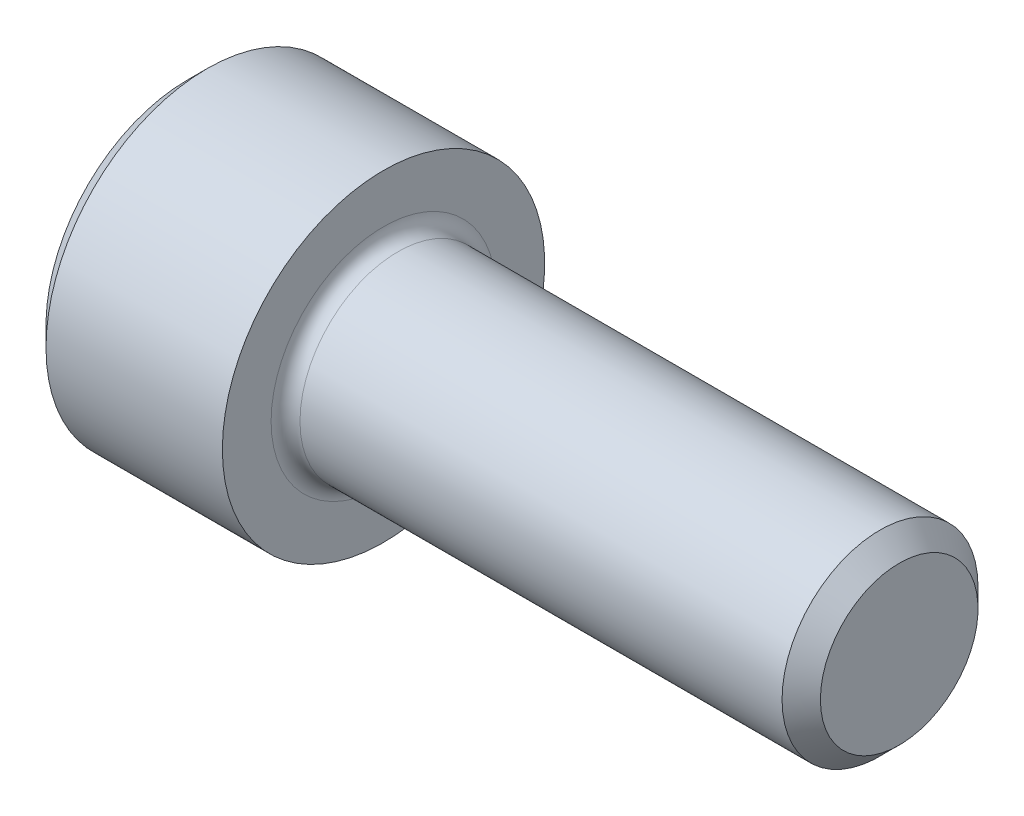
ISO-10303-21;
HEADER;
FILE_DESCRIPTION(('STEP AP214'),'2;1');
FILE_NAME('part.step','',(''),(''),'','','');
FILE_SCHEMA(('AUTOMOTIVE_DESIGN { 1 0 10303 214 1 1 1 1 }'));
ENDSEC;
DATA;
#1=APPLICATION_CONTEXT('core data for automotive mechanical design processes');
#2=APPLICATION_PROTOCOL_DEFINITION('international standard','automotive_design',2000,#1);
#3=PRODUCT_CONTEXT('',#1,'mechanical');
#4=PRODUCT('Part','Part','',(#3));
#5=PRODUCT_RELATED_PRODUCT_CATEGORY('part','',(#4));
#6=PRODUCT_DEFINITION_FORMATION('','',#4);
#7=PRODUCT_DEFINITION_CONTEXT('part definition',#1,'design');
#8=PRODUCT_DEFINITION('design','',#6,#7);
#9=PRODUCT_DEFINITION_SHAPE('','',#8);
#10=(LENGTH_UNIT() NAMED_UNIT(*) SI_UNIT(.MILLI.,.METRE.));
#11=(NAMED_UNIT(*) PLANE_ANGLE_UNIT() SI_UNIT($,.RADIAN.));
#12=(NAMED_UNIT(*) SI_UNIT($,.STERADIAN.) SOLID_ANGLE_UNIT());
#13=UNCERTAINTY_MEASURE_WITH_UNIT(LENGTH_MEASURE(1.E-05),#10,'distance_accuracy_value','');
#14=(GEOMETRIC_REPRESENTATION_CONTEXT(3) GLOBAL_UNCERTAINTY_ASSIGNED_CONTEXT((#13)) GLOBAL_UNIT_ASSIGNED_CONTEXT((#10,
#11,#12)) REPRESENTATION_CONTEXT('',''));
#15=CARTESIAN_POINT('',(0.,0.,0.));
#16=DIRECTION('',(0.,0.,1.));
#17=DIRECTION('',(1.,0.,0.));
#18=AXIS2_PLACEMENT_3D('',#15,#16,#17);
#19=CARTESIAN_POINT('',(2.286,1.14604605784411,1.98501));
#20=DIRECTION('',(-1.,0.,0.));
#21=DIRECTION('',(0.,0.,1.));
#22=AXIS2_PLACEMENT_3D('',#19,#20,#21);
#23=PLANE('',#22);
#24=DIRECTION('',(0.,0.500000000000001,0.866025403784438));
#25=VECTOR('',#24,1.);
#26=CARTESIAN_POINT('',(2.286,-1.71906908676614,0.992505));
#27=LINE('',#26,#25);
#28=CARTESIAN_POINT('',(2.2859999999804,-1.71906908679011,0.992505000013839));
#29=VERTEX_POINT('',#28);
#30=CARTESIAN_POINT('',(2.286,-1.14604605784409,1.98501));
#31=VERTEX_POINT('',#30);
#32=EDGE_CURVE('E102',#29,#31,#27,.T.);
#33=ORIENTED_EDGE('',*,*,#32,.T.);
#34=DIRECTION('',(0.,1.,0.));
#35=VECTOR('',#34,1.);
#36=CARTESIAN_POINT('',(2.286,1.14604605784411,1.98501));
#37=LINE('',#36,#35);
#38=CARTESIAN_POINT('',(2.28599999998701,0.,1.98501000001309));
#39=VERTEX_POINT('',#38);
#40=EDGE_CURVE('E97',#31,#39,#37,.T.);
#41=ORIENTED_EDGE('',*,*,#40,.T.);
#42=CARTESIAN_POINT('',(2.2859999999608,0.,0.));
#43=DIRECTION('',(-1.,0.,0.));
#44=DIRECTION('',(0.,0.,1.));
#45=AXIS2_PLACEMENT_3D('',#42,#43,#44);
#46=CIRCLE('',#45,1.98501000005535);
#47=EDGE_CURVE('E99',#39,#29,#46,.F.);
#48=ORIENTED_EDGE('',*,*,#47,.T.);
#49=EDGE_LOOP('',(#33,#41,#48));
#50=FACE_BOUND('',#49,.T.);
#51=ADVANCED_FACE('F18',(#50),#23,.T.);
#52=CARTESIAN_POINT('',(2.286,1.14604605784411,1.98501));
#53=DIRECTION('',(-1.,0.,0.));
#54=DIRECTION('',(0.,0.,1.));
#55=AXIS2_PLACEMENT_3D('',#52,#53,#54);
#56=PLANE('',#55);
#57=DIRECTION('',(0.,-0.499999999999998,0.86602540378444));
#58=VECTOR('',#57,1.);
#59=CARTESIAN_POINT('',(2.286,-1.71906908676615,-0.992504999999996));
#60=LINE('',#59,#58);
#61=CARTESIAN_POINT('',(2.2859999999804,-1.71906908679012,-0.992505000013836));
#62=VERTEX_POINT('',#61);
#63=CARTESIAN_POINT('',(2.286,-2.29209211568819,0.));
#64=VERTEX_POINT('',#63);
#65=EDGE_CURVE('E106',#62,#64,#60,.T.);
#66=ORIENTED_EDGE('',*,*,#65,.T.);
#67=DIRECTION('',(0.,0.500000000000001,0.866025403784438));
#68=VECTOR('',#67,1.);
#69=CARTESIAN_POINT('',(2.286,-2.29209211568819,0.));
#70=LINE('',#69,#68);
#71=EDGE_CURVE('E173',#64,#29,#70,.T.);
#72=ORIENTED_EDGE('',*,*,#71,.T.);
#73=CARTESIAN_POINT('',(2.2859999999608,0.,0.));
#74=DIRECTION('',(-1.,0.,0.));
#75=DIRECTION('',(0.,0.,1.));
#76=AXIS2_PLACEMENT_3D('',#73,#74,#75);
#77=CIRCLE('',#76,1.98501000005535);
#78=EDGE_CURVE('E118',#29,#62,#77,.F.);
#79=ORIENTED_EDGE('',*,*,#78,.T.);
#80=EDGE_LOOP('',(#66,#72,#79));
#81=FACE_BOUND('',#80,.T.);
#82=ADVANCED_FACE('F349',(#81),#56,.T.);
#83=CARTESIAN_POINT('',(2.286,1.14604605784411,1.98501));
#84=DIRECTION('',(-1.,0.,0.));
#85=DIRECTION('',(0.,0.,1.));
#86=AXIS2_PLACEMENT_3D('',#83,#84,#85);
#87=PLANE('',#86);
#88=DIRECTION('',(0.,1.,0.));
#89=VECTOR('',#88,1.);
#90=CARTESIAN_POINT('',(2.286,1.14604605784411,-1.98501));
#91=LINE('',#90,#89);
#92=CARTESIAN_POINT('',(2.28599999998701,0.,-1.98501000001309));
#93=VERTEX_POINT('',#92);
#94=CARTESIAN_POINT('',(2.286,-1.1460460578441,-1.98501));
#95=VERTEX_POINT('',#94);
#96=EDGE_CURVE('E168',#93,#95,#91,.F.);
#97=ORIENTED_EDGE('',*,*,#96,.T.);
#98=DIRECTION('',(0.,-0.499999999999999,0.866025403784439));
#99=VECTOR('',#98,1.);
#100=CARTESIAN_POINT('',(2.286,-1.1460460578441,-1.98501));
#101=LINE('',#100,#99);
#102=EDGE_CURVE('E163',#95,#62,#101,.T.);
#103=ORIENTED_EDGE('',*,*,#102,.T.);
#104=CARTESIAN_POINT('',(2.2859999999608,0.,0.));
#105=DIRECTION('',(-1.,0.,0.));
#106=DIRECTION('',(0.,0.,1.));
#107=AXIS2_PLACEMENT_3D('',#104,#105,#106);
#108=CIRCLE('',#107,1.98501000005535);
#109=EDGE_CURVE('E226',#62,#93,#108,.F.);
#110=ORIENTED_EDGE('',*,*,#109,.T.);
#111=EDGE_LOOP('',(#97,#103,#110));
#112=FACE_BOUND('',#111,.T.);
#113=ADVANCED_FACE('F346',(#112),#87,.T.);
#114=CARTESIAN_POINT('',(2.286,1.14604605784411,1.98501));
#115=DIRECTION('',(-1.,0.,0.));
#116=DIRECTION('',(0.,0.,1.));
#117=AXIS2_PLACEMENT_3D('',#114,#115,#116);
#118=PLANE('',#117);
#119=DIRECTION('',(0.,-0.500000000000001,-0.866025403784438));
#120=VECTOR('',#119,1.);
#121=CARTESIAN_POINT('',(2.286,1.71906908676615,-0.992505000000006));
#122=LINE('',#121,#120);
#123=CARTESIAN_POINT('',(2.2859999999804,1.71906908679012,-0.992505000013843));
#124=VERTEX_POINT('',#123);
#125=CARTESIAN_POINT('',(2.286,1.1460460578441,-1.98501));
#126=VERTEX_POINT('',#125);
#127=EDGE_CURVE('E158',#124,#126,#122,.T.);
#128=ORIENTED_EDGE('',*,*,#127,.T.);
#129=DIRECTION('',(0.,1.,0.));
#130=VECTOR('',#129,1.);
#131=CARTESIAN_POINT('',(2.286,1.14604605784411,-1.98501));
#132=LINE('',#131,#130);
#133=EDGE_CURVE('E153',#126,#93,#132,.F.);
#134=ORIENTED_EDGE('',*,*,#133,.T.);
#135=CARTESIAN_POINT('',(2.2859999999608,0.,0.));
#136=DIRECTION('',(-1.,0.,0.));
#137=DIRECTION('',(0.,0.,1.));
#138=AXIS2_PLACEMENT_3D('',#135,#136,#137);
#139=CIRCLE('',#138,1.98501000005535);
#140=EDGE_CURVE('E223',#93,#124,#139,.F.);
#141=ORIENTED_EDGE('',*,*,#140,.T.);
#142=EDGE_LOOP('',(#128,#134,#141));
#143=FACE_BOUND('',#142,.T.);
#144=ADVANCED_FACE('F342',(#143),#118,.T.);
#145=CARTESIAN_POINT('',(2.286,1.14604605784411,1.98501));
#146=DIRECTION('',(-1.,0.,0.));
#147=DIRECTION('',(0.,0.,1.));
#148=AXIS2_PLACEMENT_3D('',#145,#146,#147);
#149=PLANE('',#148);
#150=DIRECTION('',(0.,0.500000000000002,-0.866025403784437));
#151=VECTOR('',#150,1.);
#152=CARTESIAN_POINT('',(2.286,1.71906908676615,0.992504999999996));
#153=LINE('',#152,#151);
#154=CARTESIAN_POINT('',(2.2859999999804,1.71906908679012,0.992505000013835));
#155=VERTEX_POINT('',#154);
#156=CARTESIAN_POINT('',(2.286,2.2920921156882,0.));
#157=VERTEX_POINT('',#156);
#158=EDGE_CURVE('E148',#155,#157,#153,.T.);
#159=ORIENTED_EDGE('',*,*,#158,.T.);
#160=DIRECTION('',(0.,-0.500000000000002,-0.866025403784437));
#161=VECTOR('',#160,1.);
#162=CARTESIAN_POINT('',(2.286,2.2920921156882,0.));
#163=LINE('',#162,#161);
#164=EDGE_CURVE('E119',#157,#124,#163,.T.);
#165=ORIENTED_EDGE('',*,*,#164,.T.);
#166=CARTESIAN_POINT('',(2.2859999999608,0.,0.));
#167=DIRECTION('',(-1.,0.,0.));
#168=DIRECTION('',(0.,0.,1.));
#169=AXIS2_PLACEMENT_3D('',#166,#167,#168);
#170=CIRCLE('',#169,1.98501000005535);
#171=EDGE_CURVE('E126',#124,#155,#170,.F.);
#172=ORIENTED_EDGE('',*,*,#171,.T.);
#173=EDGE_LOOP('',(#159,#165,#172));
#174=FACE_BOUND('',#173,.T.);
#175=ADVANCED_FACE('F338',(#174),#149,.T.);
#176=CARTESIAN_POINT('',(2.28600000002643,0.,0.));
#177=DIRECTION('',(-1.,0.,0.));
#178=DIRECTION('',(0.,0.,1.));
#179=AXIS2_PLACEMENT_3D('',#176,#177,#178);
#180=CONICAL_SURFACE('',#179,1.98500999994167,1.04719755112655);
#181=CARTESIAN_POINT('',(3.43204605781011,0.,5.6843418860808E-11));
#182=VERTEX_POINT('',#181);
#183=VERTEX_LOOP('',#182);
#184=FACE_BOUND('',#183,.T.);
#185=ORIENTED_EDGE('',*,*,#47,.F.);
#186=CARTESIAN_POINT('',(2.2859999999608,0.,0.));
#187=DIRECTION('',(-1.,0.,0.));
#188=DIRECTION('',(0.,0.,1.));
#189=AXIS2_PLACEMENT_3D('',#186,#187,#188);
#190=CIRCLE('',#189,1.98501000005535);
#191=EDGE_CURVE('E114',#155,#39,#190,.F.);
#192=ORIENTED_EDGE('',*,*,#191,.F.);
#193=ORIENTED_EDGE('',*,*,#171,.F.);
#194=ORIENTED_EDGE('',*,*,#140,.F.);
#195=ORIENTED_EDGE('',*,*,#109,.F.);
#196=ORIENTED_EDGE('',*,*,#78,.F.);
#197=EDGE_LOOP('',(#185,#192,#193,#194,#195,#196));
#198=FACE_BOUND('',#197,.T.);
#199=ADVANCED_FACE('F112',(#184,#198),#180,.F.);
#200=CARTESIAN_POINT('',(2.286,1.14604605784411,1.98501));
#201=DIRECTION('',(-1.,0.,0.));
#202=DIRECTION('',(0.,0.,1.));
#203=AXIS2_PLACEMENT_3D('',#200,#201,#202);
#204=PLANE('',#203);
#205=DIRECTION('',(0.,-1.,0.));
#206=VECTOR('',#205,1.);
#207=CARTESIAN_POINT('',(2.286,-1.14604605784409,1.98501));
#208=LINE('',#207,#206);
#209=CARTESIAN_POINT('',(2.286,1.14604605784411,1.98501));
#210=VERTEX_POINT('',#209);
#211=EDGE_CURVE('E123',#39,#210,#208,.F.);
#212=ORIENTED_EDGE('',*,*,#211,.T.);
#213=DIRECTION('',(0.,0.499999999999998,-0.86602540378444));
#214=VECTOR('',#213,1.);
#215=CARTESIAN_POINT('',(2.286,2.2920921156882,0.));
#216=LINE('',#215,#214);
#217=EDGE_CURVE('E125',#155,#210,#216,.F.);
#218=ORIENTED_EDGE('',*,*,#217,.F.);
#219=ORIENTED_EDGE('',*,*,#191,.T.);
#220=EDGE_LOOP('',(#212,#218,#219));
#221=FACE_BOUND('',#220,.T.);
#222=ADVANCED_FACE('F122',(#221),#204,.T.);
#223=CARTESIAN_POINT('',(2.286,2.2920921156882,0.));
#224=DIRECTION('',(0.,-0.86602540378444,-0.499999999999998));
#225=DIRECTION('',(0.,0.499999999999998,-0.86602540378444));
#226=AXIS2_PLACEMENT_3D('',#223,#224,#225);
#227=PLANE('',#226);
#228=ORIENTED_EDGE('',*,*,#217,.T.);
#229=DIRECTION('',(1.,0.,0.));
#230=VECTOR('',#229,1.);
#231=CARTESIAN_POINT('',(2.286,1.14604605784411,1.98501));
#232=LINE('',#231,#230);
#233=CARTESIAN_POINT('',(0.,1.14604605784411,1.98501));
#234=VERTEX_POINT('',#233);
#235=EDGE_CURVE('E131',#210,#234,#232,.F.);
#236=ORIENTED_EDGE('',*,*,#235,.T.);
#237=DIRECTION('',(0.,-0.499999999999998,0.86602540378444));
#238=VECTOR('',#237,1.);
#239=CARTESIAN_POINT('',(0.,2.2920921156882,0.));
#240=LINE('',#239,#238);
#241=CARTESIAN_POINT('',(0.,2.2920921156882,0.));
#242=VERTEX_POINT('',#241);
#243=EDGE_CURVE('E138',#242,#234,#240,.T.);
#244=ORIENTED_EDGE('',*,*,#243,.F.);
#245=DIRECTION('',(1.,0.,0.));
#246=VECTOR('',#245,1.);
#247=CARTESIAN_POINT('',(2.286,2.2920921156882,0.));
#248=LINE('',#247,#246);
#249=EDGE_CURVE('E188',#242,#157,#248,.T.);
#250=ORIENTED_EDGE('',*,*,#249,.T.);
#251=ORIENTED_EDGE('',*,*,#158,.F.);
#252=EDGE_LOOP('',(#228,#236,#244,#250,#251));
#253=FACE_BOUND('',#252,.T.);
#254=ADVANCED_FACE('F330',(#253),#227,.T.);
#255=CARTESIAN_POINT('',(2.286,-1.14604605784409,1.98501));
#256=DIRECTION('',(0.,0.,1.));
#257=DIRECTION('',(0.,-1.,0.));
#258=AXIS2_PLACEMENT_3D('',#255,#256,#257);
#259=PLANE('',#258);
#260=ORIENTED_EDGE('',*,*,#235,.F.);
#261=ORIENTED_EDGE('',*,*,#211,.F.);
#262=ORIENTED_EDGE('',*,*,#40,.F.);
#263=DIRECTION('',(1.,0.,0.));
#264=VECTOR('',#263,1.);
#265=CARTESIAN_POINT('',(2.286,-1.14604605784409,1.98501));
#266=LINE('',#265,#264);
#267=CARTESIAN_POINT('',(0.,-1.14604605784409,1.98501));
#268=VERTEX_POINT('',#267);
#269=EDGE_CURVE('E133',#268,#31,#266,.T.);
#270=ORIENTED_EDGE('',*,*,#269,.F.);
#271=DIRECTION('',(0.,1.,0.));
#272=VECTOR('',#271,1.);
#273=CARTESIAN_POINT('',(0.,0.,1.98501));
#274=LINE('',#273,#272);
#275=EDGE_CURVE('E364',#234,#268,#274,.F.);
#276=ORIENTED_EDGE('',*,*,#275,.F.);
#277=EDGE_LOOP('',(#260,#261,#262,#270,#276));
#278=FACE_BOUND('',#277,.T.);
#279=ADVANCED_FACE('F129',(#278),#259,.F.);
#280=CARTESIAN_POINT('',(2.286,-1.14604605784409,1.98501));
#281=DIRECTION('',(0.,0.866025403784438,-0.500000000000001));
#282=DIRECTION('',(0.,0.500000000000001,0.866025403784438));
#283=AXIS2_PLACEMENT_3D('',#280,#281,#282);
#284=PLANE('',#283);
#285=ORIENTED_EDGE('',*,*,#71,.F.);
#286=DIRECTION('',(1.,0.,0.));
#287=VECTOR('',#286,1.);
#288=CARTESIAN_POINT('',(2.286,-2.29209211568819,0.));
#289=LINE('',#288,#287);
#290=CARTESIAN_POINT('',(0.,-2.29209211568819,0.));
#291=VERTEX_POINT('',#290);
#292=EDGE_CURVE('E199',#291,#64,#289,.T.);
#293=ORIENTED_EDGE('',*,*,#292,.F.);
#294=DIRECTION('',(0.,-0.500000000000001,-0.866025403784438));
#295=VECTOR('',#294,1.);
#296=CARTESIAN_POINT('',(0.,-1.14604605784409,1.98501));
#297=LINE('',#296,#295);
#298=EDGE_CURVE('E362',#268,#291,#297,.T.);
#299=ORIENTED_EDGE('',*,*,#298,.F.);
#300=ORIENTED_EDGE('',*,*,#269,.T.);
#301=ORIENTED_EDGE('',*,*,#32,.F.);
#302=EDGE_LOOP('',(#285,#293,#299,#300,#301));
#303=FACE_BOUND('',#302,.T.);
#304=ADVANCED_FACE('F323',(#303),#284,.T.);
#305=CARTESIAN_POINT('',(2.286,-2.29209211568819,0.));
#306=DIRECTION('',(0.,0.866025403784439,0.499999999999999));
#307=DIRECTION('',(0.,-0.499999999999999,0.866025403784439));
#308=AXIS2_PLACEMENT_3D('',#305,#306,#307);
#309=PLANE('',#308);
#310=ORIENTED_EDGE('',*,*,#102,.F.);
#311=DIRECTION('',(1.,0.,0.));
#312=VECTOR('',#311,1.);
#313=CARTESIAN_POINT('',(2.286,-1.1460460578441,-1.98501));
#314=LINE('',#313,#312);
#315=CARTESIAN_POINT('',(0.,-1.1460460578441,-1.98501));
#316=VERTEX_POINT('',#315);
#317=EDGE_CURVE('E192',#95,#316,#314,.F.);
#318=ORIENTED_EDGE('',*,*,#317,.T.);
#319=DIRECTION('',(0.,0.499999999999999,-0.86602540378444));
#320=VECTOR('',#319,1.);
#321=CARTESIAN_POINT('',(0.,-2.29209211568819,0.));
#322=LINE('',#321,#320);
#323=EDGE_CURVE('E359',#291,#316,#322,.T.);
#324=ORIENTED_EDGE('',*,*,#323,.F.);
#325=ORIENTED_EDGE('',*,*,#292,.T.);
#326=ORIENTED_EDGE('',*,*,#65,.F.);
#327=EDGE_LOOP('',(#310,#318,#324,#325,#326));
#328=FACE_BOUND('',#327,.T.);
#329=ADVANCED_FACE('F319',(#328),#309,.T.);
#330=CARTESIAN_POINT('',(2.286,1.1460460578441,-1.98501));
#331=DIRECTION('',(0.,0.,-1.));
#332=DIRECTION('',(0.,1.,0.));
#333=AXIS2_PLACEMENT_3D('',#330,#331,#332);
#334=PLANE('',#333);
#335=ORIENTED_EDGE('',*,*,#317,.F.);
#336=ORIENTED_EDGE('',*,*,#96,.F.);
#337=ORIENTED_EDGE('',*,*,#133,.F.);
#338=DIRECTION('',(1.,0.,0.));
#339=VECTOR('',#338,1.);
#340=CARTESIAN_POINT('',(2.286,1.1460460578441,-1.98501));
#341=LINE('',#340,#339);
#342=CARTESIAN_POINT('',(0.,1.1460460578441,-1.98501));
#343=VERTEX_POINT('',#342);
#344=EDGE_CURVE('E191',#126,#343,#341,.F.);
#345=ORIENTED_EDGE('',*,*,#344,.T.);
#346=DIRECTION('',(0.,1.,0.));
#347=VECTOR('',#346,1.);
#348=CARTESIAN_POINT('',(0.,0.,-1.98501));
#349=LINE('',#348,#347);
#350=EDGE_CURVE('E374',#316,#343,#349,.T.);
#351=ORIENTED_EDGE('',*,*,#350,.F.);
#352=EDGE_LOOP('',(#335,#336,#337,#345,#351));
#353=FACE_BOUND('',#352,.T.);
#354=ADVANCED_FACE('F315',(#353),#334,.F.);
#355=CARTESIAN_POINT('',(2.286,2.2920921156882,0.));
#356=DIRECTION('',(0.,0.866025403784438,-0.500000000000002));
#357=DIRECTION('',(0.,0.500000000000002,0.866025403784438));
#358=AXIS2_PLACEMENT_3D('',#355,#356,#357);
#359=PLANE('',#358);
#360=ORIENTED_EDGE('',*,*,#344,.F.);
#361=ORIENTED_EDGE('',*,*,#127,.F.);
#362=ORIENTED_EDGE('',*,*,#164,.F.);
#363=ORIENTED_EDGE('',*,*,#249,.F.);
#364=DIRECTION('',(0.,0.500000000000002,0.866025403784438));
#365=VECTOR('',#364,1.);
#366=CARTESIAN_POINT('',(0.,1.1460460578441,-1.98501));
#367=LINE('',#366,#365);
#368=EDGE_CURVE('E219',#343,#242,#367,.T.);
#369=ORIENTED_EDGE('',*,*,#368,.F.);
#370=EDGE_LOOP('',(#360,#361,#362,#363,#369));
#371=FACE_BOUND('',#370,.T.);
#372=ADVANCED_FACE('F311',(#371),#359,.F.);
#373=CARTESIAN_POINT('',(0.,0.,0.));
#374=DIRECTION('',(-1.,0.,0.));
#375=DIRECTION('',(0.,0.,1.));
#376=AXIS2_PLACEMENT_3D('',#373,#374,#375);
#377=PLANE('',#376);
#378=CARTESIAN_POINT('',(-5.6843418860808E-11,0.,0.));
#379=DIRECTION('',(1.,0.,0.));
#380=DIRECTION('',(0.,1.,0.));
#381=AXIS2_PLACEMENT_3D('',#378,#379,#380);
#382=CIRCLE('',#381,3.48615000001473);
#383=CARTESIAN_POINT('',(-5.68434426698877E-11,3.48615000001473,0.));
#384=VERTEX_POINT('',#383);
#385=EDGE_CURVE('E217',#384,#384,#382,.T.);
#386=ORIENTED_EDGE('',*,*,#385,.F.);
#387=EDGE_LOOP('',(#386));
#388=FACE_BOUND('',#387,.T.);
#389=ORIENTED_EDGE('',*,*,#350,.T.);
#390=ORIENTED_EDGE('',*,*,#368,.T.);
#391=ORIENTED_EDGE('',*,*,#243,.T.);
#392=ORIENTED_EDGE('',*,*,#275,.T.);
#393=ORIENTED_EDGE('',*,*,#298,.T.);
#394=ORIENTED_EDGE('',*,*,#323,.T.);
#395=EDGE_LOOP('',(#389,#390,#391,#392,#393,#394));
#396=FACE_BOUND('',#395,.T.);
#397=ADVANCED_FACE('F303',(#388,#396),#377,.T.);
#398=CARTESIAN_POINT('',(0.482599999998001,0.,0.));
#399=DIRECTION('',(1.,0.,0.));
#400=DIRECTION('',(0.,1.,0.));
#401=AXIS2_PLACEMENT_3D('',#398,#399,#400);
#402=CONICAL_SURFACE('',#401,3.96875000006958,0.785398163397448);
#403=ORIENTED_EDGE('',*,*,#385,.T.);
#404=EDGE_LOOP('',(#403));
#405=FACE_BOUND('',#404,.T.);
#406=CARTESIAN_POINT('',(0.4826,0.,0.));
#407=DIRECTION('',(-1.,0.,0.));
#408=DIRECTION('',(0.,0.,1.));
#409=AXIS2_PLACEMENT_3D('',#406,#407,#408);
#410=CIRCLE('',#409,3.96875);
#411=CARTESIAN_POINT('',(0.4826,0.,3.96875));
#412=VERTEX_POINT('',#411);
#413=EDGE_CURVE('E216',#412,#412,#410,.F.);
#414=ORIENTED_EDGE('',*,*,#413,.F.);
#415=EDGE_LOOP('',(#414));
#416=FACE_BOUND('',#415,.T.);
#417=ADVANCED_FACE('F298',(#405,#416),#402,.T.);
#418=CARTESIAN_POINT('',(-31.75,0.,0.));
#419=DIRECTION('',(-1.,0.,0.));
#420=DIRECTION('',(0.,0.,1.));
#421=AXIS2_PLACEMENT_3D('',#418,#419,#420);
#422=CYLINDRICAL_SURFACE('',#421,3.96875);
#423=CARTESIAN_POINT('',(4.826,0.,0.));
#424=DIRECTION('',(-1.,0.,0.));
#425=DIRECTION('',(0.,0.,1.));
#426=AXIS2_PLACEMENT_3D('',#423,#424,#425);
#427=CIRCLE('',#426,3.96875);
#428=CARTESIAN_POINT('',(4.826,0.,3.96875));
#429=VERTEX_POINT('',#428);
#430=EDGE_CURVE('E213',#429,#429,#427,.F.);
#431=ORIENTED_EDGE('',*,*,#430,.F.);
#432=EDGE_LOOP('',(#431));
#433=FACE_BOUND('',#432,.T.);
#434=ORIENTED_EDGE('',*,*,#413,.T.);
#435=EDGE_LOOP('',(#434));
#436=FACE_BOUND('',#435,.T.);
#437=ADVANCED_FACE('F294',(#433,#436),#422,.T.);
#438=CARTESIAN_POINT('',(17.526,1.94056,0.));
#439=DIRECTION('',(1.,0.,0.));
#440=DIRECTION('',(0.,0.,-1.));
#441=AXIS2_PLACEMENT_3D('',#438,#439,#440);
#442=PLANE('',#441);
#443=CARTESIAN_POINT('',(17.5259999999753,0.,0.));
#444=DIRECTION('',(-1.,0.,0.));
#445=DIRECTION('',(0.,0.,1.));
#446=AXIS2_PLACEMENT_3D('',#443,#444,#445);
#447=CIRCLE('',#446,1.94055999998);
#448=CARTESIAN_POINT('',(17.5259999999753,0.,1.94055999998));
#449=VERTEX_POINT('',#448);
#450=EDGE_CURVE('E209',#449,#449,#447,.T.);
#451=ORIENTED_EDGE('',*,*,#450,.F.);
#452=EDGE_LOOP('',(#451));
#453=FACE_BOUND('',#452,.T.);
#454=ADVANCED_FACE('F252',(#453),#442,.T.);
#455=CARTESIAN_POINT('',(4.826,3.96875,0.));
#456=DIRECTION('',(1.,0.,0.));
#457=DIRECTION('',(0.,0.,-1.));
#458=AXIS2_PLACEMENT_3D('',#455,#456,#457);
#459=PLANE('',#458);
#460=ORIENTED_EDGE('',*,*,#430,.T.);
#461=EDGE_LOOP('',(#460));
#462=FACE_BOUND('',#461,.T.);
#463=CARTESIAN_POINT('',(4.826,0.,0.));
#464=DIRECTION('',(1.,0.,0.));
#465=DIRECTION('',(0.,0.,1.));
#466=AXIS2_PLACEMENT_3D('',#463,#464,#465);
#467=CIRCLE('',#466,2.76859999999999);
#468=CARTESIAN_POINT('',(4.826,0.,-2.76859999999999));
#469=VERTEX_POINT('',#468);
#470=CARTESIAN_POINT('',(4.826,0.,2.76859999999999));
#471=VERTEX_POINT('',#470);
#472=EDGE_CURVE('E212',#469,#471,#467,.F.);
#473=ORIENTED_EDGE('',*,*,#472,.T.);
#474=CARTESIAN_POINT('',(4.826,0.,0.));
#475=DIRECTION('',(1.,0.,0.));
#476=DIRECTION('',(0.,0.,-1.));
#477=AXIS2_PLACEMENT_3D('',#474,#475,#476);
#478=CIRCLE('',#477,2.76859999999999);
#479=EDGE_CURVE('E37',#471,#469,#478,.F.);
#480=ORIENTED_EDGE('',*,*,#479,.T.);
#481=EDGE_LOOP('',(#473,#480));
#482=FACE_BOUND('',#481,.T.);
#483=ADVANCED_FACE('F233',(#462,#482),#459,.T.);
#484=CARTESIAN_POINT('',(17.0535599999084,0.,0.));
#485=DIRECTION('',(-1.,0.,0.));
#486=DIRECTION('',(0.,0.,1.));
#487=AXIS2_PLACEMENT_3D('',#484,#485,#486);
#488=CONICAL_SURFACE('',#487,2.41299999999001,0.785398163337289);
#489=CARTESIAN_POINT('',(17.05356,0.,0.));
#490=DIRECTION('',(-1.,0.,0.));
#491=DIRECTION('',(0.,0.,1.));
#492=AXIS2_PLACEMENT_3D('',#489,#490,#491);
#493=CIRCLE('',#492,2.41299999999999);
#494=CARTESIAN_POINT('',(17.05356,0.,2.41299999999999));
#495=VERTEX_POINT('',#494);
#496=EDGE_CURVE('E29',#495,#495,#493,.T.);
#497=ORIENTED_EDGE('',*,*,#496,.F.);
#498=EDGE_LOOP('',(#497));
#499=FACE_BOUND('',#498,.T.);
#500=ORIENTED_EDGE('',*,*,#450,.T.);
#501=EDGE_LOOP('',(#500));
#502=FACE_BOUND('',#501,.T.);
#503=ADVANCED_FACE('F251',(#499,#502),#488,.T.);
#504=CARTESIAN_POINT('',(5.1816,0.,0.));
#505=DIRECTION('',(1.,0.,0.));
#506=DIRECTION('',(0.,0.,-1.));
#507=AXIS2_PLACEMENT_3D('',#504,#505,#506);
#508=TOROIDAL_SURFACE('',#507,2.76859999999999,0.3556);
#509=CARTESIAN_POINT('',(5.1816,0.,0.));
#510=DIRECTION('',(-1.,0.,0.));
#511=DIRECTION('',(0.,0.,1.));
#512=AXIS2_PLACEMENT_3D('',#509,#510,#511);
#513=CIRCLE('',#512,2.41299999999999);
#514=CARTESIAN_POINT('',(5.1816,0.,2.41299999999999));
#515=VERTEX_POINT('',#514);
#516=EDGE_CURVE('E11',#515,#515,#513,.F.);
#517=ORIENTED_EDGE('',*,*,#516,.F.);
#518=EDGE_LOOP('',(#517));
#519=FACE_BOUND('',#518,.T.);
#520=ORIENTED_EDGE('',*,*,#472,.F.);
#521=ORIENTED_EDGE('',*,*,#479,.F.);
#522=EDGE_LOOP('',(#520,#521));
#523=FACE_BOUND('',#522,.T.);
#524=ADVANCED_FACE('F230',(#519,#523),#508,.F.);
#525=CARTESIAN_POINT('',(-31.75,0.,0.));
#526=DIRECTION('',(-1.,0.,0.));
#527=DIRECTION('',(0.,0.,1.));
#528=AXIS2_PLACEMENT_3D('',#525,#526,#527);
#529=CYLINDRICAL_SURFACE('',#528,2.41299999999999);
#530=ORIENTED_EDGE('',*,*,#516,.T.);
#531=EDGE_LOOP('',(#530));
#532=FACE_BOUND('',#531,.T.);
#533=ORIENTED_EDGE('',*,*,#496,.T.);
#534=EDGE_LOOP('',(#533));
#535=FACE_BOUND('',#534,.T.);
#536=ADVANCED_FACE('F276',(#532,#535),#529,.T.);
#537=CLOSED_SHELL('',(#51,#82,#113,#144,#175,#199,#222,#254,#279,#304,#329,#354,#372,#397,#417,
#437,#454,#483,#503,#524,#536));
#538=MANIFOLD_SOLID_BREP('B1',#537);
#539=ADVANCED_BREP_SHAPE_REPRESENTATION('',(#18,#538),#14);
#540=SHAPE_DEFINITION_REPRESENTATION(#9,#539);
ENDSEC;
END-ISO-10303-21;
